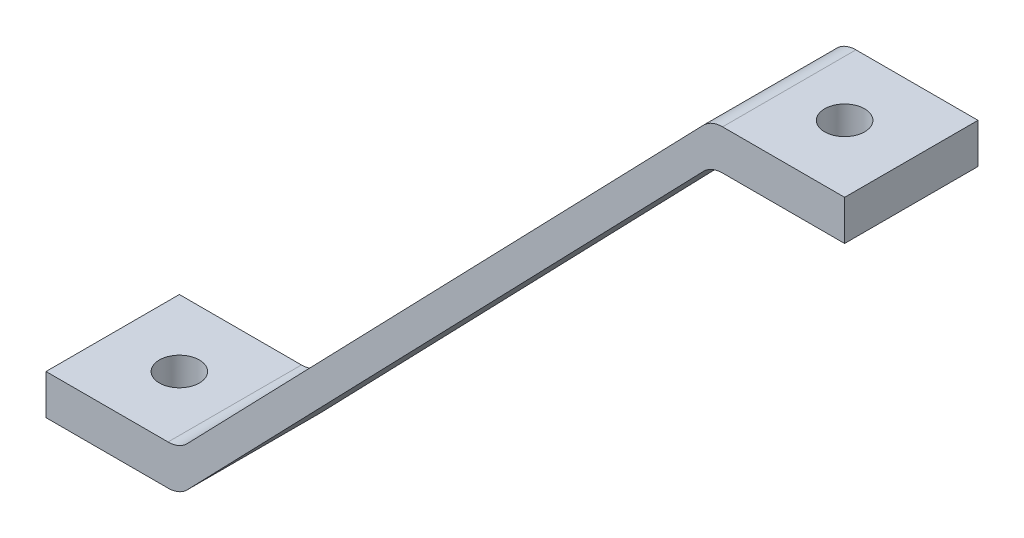
ISO-10303-21;
HEADER;
FILE_DESCRIPTION(('STEP AP214'),'2;1');
FILE_NAME('part.step','',(''),(''),'','','');
FILE_SCHEMA(('AUTOMOTIVE_DESIGN { 1 0 10303 214 1 1 1 1 }'));
ENDSEC;
DATA;
#1=APPLICATION_CONTEXT('core data for automotive mechanical design processes');
#2=APPLICATION_PROTOCOL_DEFINITION('international standard','automotive_design',2000,#1);
#3=PRODUCT_CONTEXT('',#1,'mechanical');
#4=PRODUCT('Part','Part','',(#3));
#5=PRODUCT_RELATED_PRODUCT_CATEGORY('part','',(#4));
#6=PRODUCT_DEFINITION_FORMATION('','',#4);
#7=PRODUCT_DEFINITION_CONTEXT('part definition',#1,'design');
#8=PRODUCT_DEFINITION('design','',#6,#7);
#9=PRODUCT_DEFINITION_SHAPE('','',#8);
#10=(LENGTH_UNIT() NAMED_UNIT(*) SI_UNIT(.MILLI.,.METRE.));
#11=(NAMED_UNIT(*) PLANE_ANGLE_UNIT() SI_UNIT($,.RADIAN.));
#12=(NAMED_UNIT(*) SI_UNIT($,.STERADIAN.) SOLID_ANGLE_UNIT());
#13=UNCERTAINTY_MEASURE_WITH_UNIT(LENGTH_MEASURE(1.E-05),#10,'distance_accuracy_value','');
#14=(GEOMETRIC_REPRESENTATION_CONTEXT(3) GLOBAL_UNCERTAINTY_ASSIGNED_CONTEXT((#13)) GLOBAL_UNIT_ASSIGNED_CONTEXT((#10,
#11,#12)) REPRESENTATION_CONTEXT('',''));
#15=CARTESIAN_POINT('',(0.,0.,0.));
#16=DIRECTION('',(0.,0.,1.));
#17=DIRECTION('',(1.,0.,0.));
#18=AXIS2_PLACEMENT_3D('',#15,#16,#17);
#19=CARTESIAN_POINT('',(0.,3.81,0.));
#20=DIRECTION('',(1.,0.,0.));
#21=DIRECTION('',(0.,0.,-1.));
#22=AXIS2_PLACEMENT_3D('',#19,#20,#21);
#23=PLANE('',#22);
#24=DIRECTION('',(0.,0.,1.));
#25=VECTOR('',#24,1.);
#26=CARTESIAN_POINT('',(0.,0.,0.));
#27=LINE('',#26,#25);
#28=CARTESIAN_POINT('',(0.,0.,-12.7));
#29=VERTEX_POINT('',#28);
#30=CARTESIAN_POINT('',(0.,0.,0.));
#31=VERTEX_POINT('',#30);
#32=EDGE_CURVE('E173',#29,#31,#27,.T.);
#33=ORIENTED_EDGE('',*,*,#32,.T.);
#34=DIRECTION('',(0.,-1.,0.));
#35=VECTOR('',#34,1.);
#36=CARTESIAN_POINT('',(0.,3.81,0.));
#37=LINE('',#36,#35);
#38=CARTESIAN_POINT('',(0.,3.81,0.));
#39=VERTEX_POINT('',#38);
#40=EDGE_CURVE('E200',#39,#31,#37,.T.);
#41=ORIENTED_EDGE('',*,*,#40,.F.);
#42=DIRECTION('',(0.,0.,1.));
#43=VECTOR('',#42,1.);
#44=CARTESIAN_POINT('',(0.,3.81,0.));
#45=LINE('',#44,#43);
#46=CARTESIAN_POINT('',(0.,3.81,-12.7));
#47=VERTEX_POINT('',#46);
#48=EDGE_CURVE('E175',#47,#39,#45,.T.);
#49=ORIENTED_EDGE('',*,*,#48,.F.);
#50=DIRECTION('',(0.,-1.,0.));
#51=VECTOR('',#50,1.);
#52=CARTESIAN_POINT('',(0.,3.81,-12.7));
#53=LINE('',#52,#51);
#54=EDGE_CURVE('E187',#47,#29,#53,.T.);
#55=ORIENTED_EDGE('',*,*,#54,.T.);
#56=EDGE_LOOP('',(#33,#41,#49,#55));
#57=FACE_BOUND('',#56,.T.);
#58=ADVANCED_FACE('F38',(#57),#23,.F.);
#59=CARTESIAN_POINT('',(0.,3.81,0.));
#60=DIRECTION('',(0.,0.,-1.));
#61=DIRECTION('',(-1.,0.,0.));
#62=AXIS2_PLACEMENT_3D('',#59,#60,#61);
#63=PLANE('',#62);
#64=DIRECTION('',(-1.,0.,0.));
#65=VECTOR('',#64,1.);
#66=CARTESIAN_POINT('',(63.3482559246675,56.1975,0.));
#67=LINE('',#66,#65);
#68=CARTESIAN_POINT('',(76.0482559246675,56.1975000000001,0.));
#69=VERTEX_POINT('',#68);
#70=CARTESIAN_POINT('',(64.4255604014743,56.1975,0.));
#71=VERTEX_POINT('',#70);
#72=EDGE_CURVE('E159',#69,#71,#67,.T.);
#73=ORIENTED_EDGE('',*,*,#72,.T.);
#74=CARTESIAN_POINT('',(64.4255604014743,53.6575,0.));
#75=DIRECTION('',(0.,0.,-1.));
#76=DIRECTION('',(-1.,0.,0.));
#77=AXIS2_PLACEMENT_3D('',#74,#75,#76);
#78=CIRCLE('',#77,2.54);
#79=CARTESIAN_POINT('',(62.5994519657933,55.4229823650025,0.));
#80=VERTEX_POINT('',#79);
#81=EDGE_CURVE('E211',#71,#80,#78,.F.);
#82=ORIENTED_EDGE('',*,*,#81,.T.);
#83=DIRECTION('',(-0.69507179724506,-0.718940329008272,0.));
#84=VECTOR('',#83,1.);
#85=CARTESIAN_POINT('',(63.3482559246675,56.1975,0.));
#86=LINE('',#85,#84);
#87=CARTESIAN_POINT('',(13.4488039588743,4.58451763499756,0.));
#88=VERTEX_POINT('',#87);
#89=EDGE_CURVE('E153',#80,#88,#86,.T.);
#90=ORIENTED_EDGE('',*,*,#89,.T.);
#91=CARTESIAN_POINT('',(11.6226955231932,6.35,0.));
#92=DIRECTION('',(0.,0.,-1.));
#93=DIRECTION('',(-1.,0.,0.));
#94=AXIS2_PLACEMENT_3D('',#91,#92,#93);
#95=CIRCLE('',#94,2.54);
#96=CARTESIAN_POINT('',(11.6226955231932,3.81,0.));
#97=VERTEX_POINT('',#96);
#98=EDGE_CURVE('E11',#88,#97,#95,.T.);
#99=ORIENTED_EDGE('',*,*,#98,.T.);
#100=DIRECTION('',(1.,0.,0.));
#101=VECTOR('',#100,1.);
#102=CARTESIAN_POINT('',(0.,3.81,0.));
#103=LINE('',#102,#101);
#104=EDGE_CURVE('E179',#39,#97,#103,.T.);
#105=ORIENTED_EDGE('',*,*,#104,.F.);
#106=ORIENTED_EDGE('',*,*,#40,.T.);
#107=DIRECTION('',(1.,0.,0.));
#108=VECTOR('',#107,1.);
#109=CARTESIAN_POINT('',(0.,0.,0.));
#110=LINE('',#109,#108);
#111=CARTESIAN_POINT('',(11.6226955231932,0.,0.));
#112=VERTEX_POINT('',#111);
#113=EDGE_CURVE('E191',#31,#112,#110,.T.);
#114=ORIENTED_EDGE('',*,*,#113,.T.);
#115=CARTESIAN_POINT('',(11.6226955231932,2.54,0.));
#116=DIRECTION('',(0.,0.,-1.));
#117=DIRECTION('',(-1.,0.,0.));
#118=AXIS2_PLACEMENT_3D('',#115,#116,#117);
#119=CIRCLE('',#118,2.54);
#120=CARTESIAN_POINT('',(13.4488039588742,0.774517634997547,0.));
#121=VERTEX_POINT('',#120);
#122=EDGE_CURVE('E208',#112,#121,#119,.F.);
#123=ORIENTED_EDGE('',*,*,#122,.T.);
#124=DIRECTION('',(0.69507179724506,0.718940329008272,0.));
#125=VECTOR('',#124,1.);
#126=CARTESIAN_POINT('',(12.7,0.,0.));
#127=LINE('',#126,#125);
#128=CARTESIAN_POINT('',(62.5994519657933,51.6129823650025,0.));
#129=VERTEX_POINT('',#128);
#130=EDGE_CURVE('E142',#121,#129,#127,.T.);
#131=ORIENTED_EDGE('',*,*,#130,.T.);
#132=CARTESIAN_POINT('',(64.4255604014743,49.8475,0.));
#133=DIRECTION('',(0.,0.,-1.));
#134=DIRECTION('',(-1.,0.,0.));
#135=AXIS2_PLACEMENT_3D('',#132,#133,#134);
#136=CIRCLE('',#135,2.54);
#137=CARTESIAN_POINT('',(64.4255604014743,52.3875,0.));
#138=VERTEX_POINT('',#137);
#139=EDGE_CURVE('E138',#129,#138,#136,.T.);
#140=ORIENTED_EDGE('',*,*,#139,.T.);
#141=DIRECTION('',(1.,0.,0.));
#142=VECTOR('',#141,1.);
#143=CARTESIAN_POINT('',(63.3482559246675,52.3875,0.));
#144=LINE('',#143,#142);
#145=CARTESIAN_POINT('',(76.0482559246675,52.3875,0.));
#146=VERTEX_POINT('',#145);
#147=EDGE_CURVE('E131',#138,#146,#144,.T.);
#148=ORIENTED_EDGE('',*,*,#147,.T.);
#149=DIRECTION('',(0.,1.,0.));
#150=VECTOR('',#149,1.);
#151=CARTESIAN_POINT('',(76.0482559246675,52.3875,0.));
#152=LINE('',#151,#150);
#153=EDGE_CURVE('E136',#146,#69,#152,.T.);
#154=ORIENTED_EDGE('',*,*,#153,.T.);
#155=EDGE_LOOP('',(#73,#82,#90,#99,#105,#106,#114,#123,#131,#140,#148,#154));
#156=FACE_BOUND('',#155,.T.);
#157=ADVANCED_FACE('F134',(#156),#63,.F.);
#158=CARTESIAN_POINT('',(0.,3.81,-12.7));
#159=DIRECTION('',(0.,0.,1.));
#160=DIRECTION('',(1.,0.,0.));
#161=AXIS2_PLACEMENT_3D('',#158,#159,#160);
#162=PLANE('',#161);
#163=DIRECTION('',(0.69507179724506,0.718940329008272,0.));
#164=VECTOR('',#163,1.);
#165=CARTESIAN_POINT('',(63.3482559246675,56.1975,-12.7));
#166=LINE('',#165,#164);
#167=CARTESIAN_POINT('',(13.4488039588742,4.58451763499754,-12.7));
#168=VERTEX_POINT('',#167);
#169=CARTESIAN_POINT('',(62.5994519657933,55.4229823650025,-12.7));
#170=VERTEX_POINT('',#169);
#171=EDGE_CURVE('E174',#168,#170,#166,.T.);
#172=ORIENTED_EDGE('',*,*,#171,.T.);
#173=CARTESIAN_POINT('',(64.4255604014743,53.6575,-12.7));
#174=DIRECTION('',(0.,0.,1.));
#175=DIRECTION('',(1.,0.,0.));
#176=AXIS2_PLACEMENT_3D('',#173,#174,#175);
#177=CIRCLE('',#176,2.54);
#178=CARTESIAN_POINT('',(64.4255604014743,56.1975,-12.7));
#179=VERTEX_POINT('',#178);
#180=EDGE_CURVE('E222',#170,#179,#177,.F.);
#181=ORIENTED_EDGE('',*,*,#180,.T.);
#182=DIRECTION('',(1.,0.,0.));
#183=VECTOR('',#182,1.);
#184=CARTESIAN_POINT('',(63.3482559246675,56.1975,-12.7));
#185=LINE('',#184,#183);
#186=CARTESIAN_POINT('',(76.0482559246675,56.1975000000001,-12.7));
#187=VERTEX_POINT('',#186);
#188=EDGE_CURVE('E261',#179,#187,#185,.T.);
#189=ORIENTED_EDGE('',*,*,#188,.T.);
#190=DIRECTION('',(0.,-1.,0.));
#191=VECTOR('',#190,1.);
#192=CARTESIAN_POINT('',(76.0482559246675,52.3875,-12.7));
#193=LINE('',#192,#191);
#194=CARTESIAN_POINT('',(76.0482559246675,52.3875,-12.7));
#195=VERTEX_POINT('',#194);
#196=EDGE_CURVE('E444',#187,#195,#193,.T.);
#197=ORIENTED_EDGE('',*,*,#196,.T.);
#198=DIRECTION('',(-1.,0.,0.));
#199=VECTOR('',#198,1.);
#200=CARTESIAN_POINT('',(63.3482559246675,52.3875,-12.7));
#201=LINE('',#200,#199);
#202=CARTESIAN_POINT('',(64.4255604014743,52.3875,-12.7));
#203=VERTEX_POINT('',#202);
#204=EDGE_CURVE('E148',#195,#203,#201,.T.);
#205=ORIENTED_EDGE('',*,*,#204,.T.);
#206=CARTESIAN_POINT('',(64.4255604014743,49.8475,-12.7));
#207=DIRECTION('',(0.,0.,1.));
#208=DIRECTION('',(1.,0.,0.));
#209=AXIS2_PLACEMENT_3D('',#206,#207,#208);
#210=CIRCLE('',#209,2.54);
#211=CARTESIAN_POINT('',(62.5994519657933,51.6129823650025,-12.7));
#212=VERTEX_POINT('',#211);
#213=EDGE_CURVE('E63',#203,#212,#210,.T.);
#214=ORIENTED_EDGE('',*,*,#213,.T.);
#215=DIRECTION('',(-0.69507179724506,-0.718940329008272,0.));
#216=VECTOR('',#215,1.);
#217=CARTESIAN_POINT('',(12.7,0.,-12.7));
#218=LINE('',#217,#216);
#219=CARTESIAN_POINT('',(13.4488039588742,0.774517634997547,-12.7));
#220=VERTEX_POINT('',#219);
#221=EDGE_CURVE('E170',#212,#220,#218,.T.);
#222=ORIENTED_EDGE('',*,*,#221,.T.);
#223=CARTESIAN_POINT('',(11.6226955231932,2.54,-12.7));
#224=DIRECTION('',(0.,0.,1.));
#225=DIRECTION('',(1.,0.,0.));
#226=AXIS2_PLACEMENT_3D('',#223,#224,#225);
#227=CIRCLE('',#226,2.54);
#228=CARTESIAN_POINT('',(11.6226955231932,0.,-12.7));
#229=VERTEX_POINT('',#228);
#230=EDGE_CURVE('E55',#220,#229,#227,.F.);
#231=ORIENTED_EDGE('',*,*,#230,.T.);
#232=DIRECTION('',(-1.,0.,0.));
#233=VECTOR('',#232,1.);
#234=CARTESIAN_POINT('',(0.,0.,-12.7));
#235=LINE('',#234,#233);
#236=EDGE_CURVE('E180',#229,#29,#235,.T.);
#237=ORIENTED_EDGE('',*,*,#236,.T.);
#238=ORIENTED_EDGE('',*,*,#54,.F.);
#239=DIRECTION('',(-1.,0.,0.));
#240=VECTOR('',#239,1.);
#241=CARTESIAN_POINT('',(0.,3.81,-12.7));
#242=LINE('',#241,#240);
#243=CARTESIAN_POINT('',(11.6226955231932,3.81,-12.7));
#244=VERTEX_POINT('',#243);
#245=EDGE_CURVE('E184',#244,#47,#242,.T.);
#246=ORIENTED_EDGE('',*,*,#245,.F.);
#247=CARTESIAN_POINT('',(11.6226955231932,6.35,-12.7));
#248=DIRECTION('',(0.,0.,1.));
#249=DIRECTION('',(1.,0.,0.));
#250=AXIS2_PLACEMENT_3D('',#247,#248,#249);
#251=CIRCLE('',#250,2.54);
#252=EDGE_CURVE('E48',#244,#168,#251,.T.);
#253=ORIENTED_EDGE('',*,*,#252,.T.);
#254=EDGE_LOOP('',(#172,#181,#189,#197,#205,#214,#222,#231,#237,#238,#246,#253));
#255=FACE_BOUND('',#254,.T.);
#256=ADVANCED_FACE('F250',(#255),#162,.F.);
#257=CARTESIAN_POINT('',(0.,3.81,0.));
#258=DIRECTION('',(0.,-1.,0.));
#259=DIRECTION('',(0.,0.,-1.));
#260=AXIS2_PLACEMENT_3D('',#257,#258,#259);
#261=PLANE('',#260);
#262=CARTESIAN_POINT('',(6.35,3.81,-6.35));
#263=DIRECTION('',(0.,-1.,0.));
#264=DIRECTION('',(0.,0.,-1.));
#265=AXIS2_PLACEMENT_3D('',#262,#263,#264);
#266=CIRCLE('',#265,1.905);
#267=CARTESIAN_POINT('',(6.35,3.81,-8.255));
#268=VERTEX_POINT('',#267);
#269=EDGE_CURVE('E429',#268,#268,#266,.T.);
#270=ORIENTED_EDGE('',*,*,#269,.T.);
#271=EDGE_LOOP('',(#270));
#272=FACE_BOUND('',#271,.T.);
#273=ORIENTED_EDGE('',*,*,#104,.T.);
#274=DIRECTION('',(0.,0.,-1.));
#275=VECTOR('',#274,1.);
#276=CARTESIAN_POINT('',(11.6226955231932,3.81,0.));
#277=LINE('',#276,#275);
#278=EDGE_CURVE('E238',#97,#244,#277,.T.);
#279=ORIENTED_EDGE('',*,*,#278,.T.);
#280=ORIENTED_EDGE('',*,*,#245,.T.);
#281=ORIENTED_EDGE('',*,*,#48,.T.);
#282=EDGE_LOOP('',(#273,#279,#280,#281));
#283=FACE_BOUND('',#282,.T.);
#284=ADVANCED_FACE('F265',(#272,#283),#261,.F.);
#285=CARTESIAN_POINT('',(0.,0.,0.));
#286=DIRECTION('',(0.,-1.,0.));
#287=DIRECTION('',(0.,0.,-1.));
#288=AXIS2_PLACEMENT_3D('',#285,#286,#287);
#289=PLANE('',#288);
#290=CARTESIAN_POINT('',(6.35,0.,-6.35));
#291=DIRECTION('',(0.,1.,0.));
#292=DIRECTION('',(0.,0.,1.));
#293=AXIS2_PLACEMENT_3D('',#290,#291,#292);
#294=CIRCLE('',#293,1.905);
#295=CARTESIAN_POINT('',(6.35,0.,-4.445));
#296=VERTEX_POINT('',#295);
#297=EDGE_CURVE('E430',#296,#296,#294,.T.);
#298=ORIENTED_EDGE('',*,*,#297,.T.);
#299=EDGE_LOOP('',(#298));
#300=FACE_BOUND('',#299,.T.);
#301=ORIENTED_EDGE('',*,*,#236,.F.);
#302=DIRECTION('',(0.,0.,-1.));
#303=VECTOR('',#302,1.);
#304=CARTESIAN_POINT('',(11.6226955231932,0.,0.));
#305=LINE('',#304,#303);
#306=EDGE_CURVE('E235',#229,#112,#305,.F.);
#307=ORIENTED_EDGE('',*,*,#306,.T.);
#308=ORIENTED_EDGE('',*,*,#113,.F.);
#309=ORIENTED_EDGE('',*,*,#32,.F.);
#310=EDGE_LOOP('',(#301,#307,#308,#309));
#311=FACE_BOUND('',#310,.T.);
#312=ADVANCED_FACE('F278',(#300,#311),#289,.T.);
#313=CARTESIAN_POINT('',(63.3482559246675,56.1975,-97.3827050521367));
#314=DIRECTION('',(-0.718940329008272,0.69507179724506,0.));
#315=DIRECTION('',(-0.69507179724506,-0.718940329008272,0.));
#316=AXIS2_PLACEMENT_3D('',#313,#314,#315);
#317=PLANE('',#316);
#318=ORIENTED_EDGE('',*,*,#89,.F.);
#319=DIRECTION('',(0.,0.,1.));
#320=VECTOR('',#319,1.);
#321=CARTESIAN_POINT('',(62.5994519657933,55.4229823650025,-97.3827050521367));
#322=LINE('',#321,#320);
#323=EDGE_CURVE('E217',#80,#170,#322,.F.);
#324=ORIENTED_EDGE('',*,*,#323,.T.);
#325=ORIENTED_EDGE('',*,*,#171,.F.);
#326=DIRECTION('',(0.,0.,-1.));
#327=VECTOR('',#326,1.);
#328=CARTESIAN_POINT('',(13.4488039588742,4.58451763499754,-97.3827050521367));
#329=LINE('',#328,#327);
#330=EDGE_CURVE('E214',#168,#88,#329,.F.);
#331=ORIENTED_EDGE('',*,*,#330,.T.);
#332=EDGE_LOOP('',(#318,#324,#325,#331));
#333=FACE_BOUND('',#332,.T.);
#334=ADVANCED_FACE('F258',(#333),#317,.T.);
#335=CARTESIAN_POINT('',(63.3482559246675,56.1975,-97.3827050521367));
#336=DIRECTION('',(0.,1.,0.));
#337=DIRECTION('',(-1.,0.,0.));
#338=AXIS2_PLACEMENT_3D('',#335,#336,#337);
#339=PLANE('',#338);
#340=CARTESIAN_POINT('',(69.6982559246675,56.1975000000001,-6.35));
#341=DIRECTION('',(0.,1.,0.));
#342=DIRECTION('',(0.,0.,1.));
#343=AXIS2_PLACEMENT_3D('',#340,#341,#342);
#344=CIRCLE('',#343,1.90500000000001);
#345=CARTESIAN_POINT('',(69.6982559246675,56.1975000000001,-4.445));
#346=VERTEX_POINT('',#345);
#347=EDGE_CURVE('E435',#346,#346,#344,.T.);
#348=ORIENTED_EDGE('',*,*,#347,.F.);
#349=EDGE_LOOP('',(#348));
#350=FACE_BOUND('',#349,.T.);
#351=ORIENTED_EDGE('',*,*,#188,.F.);
#352=DIRECTION('',(0.,0.,1.));
#353=VECTOR('',#352,1.);
#354=CARTESIAN_POINT('',(64.4255604014743,56.1975,-97.3827050521367));
#355=LINE('',#354,#353);
#356=EDGE_CURVE('E204',#179,#71,#355,.T.);
#357=ORIENTED_EDGE('',*,*,#356,.T.);
#358=ORIENTED_EDGE('',*,*,#72,.F.);
#359=DIRECTION('',(0.,0.,1.));
#360=VECTOR('',#359,1.);
#361=CARTESIAN_POINT('',(76.0482559246675,56.1975000000001,-97.3827050521367));
#362=LINE('',#361,#360);
#363=EDGE_CURVE('E152',#187,#69,#362,.T.);
#364=ORIENTED_EDGE('',*,*,#363,.F.);
#365=EDGE_LOOP('',(#351,#357,#358,#364));
#366=FACE_BOUND('',#365,.T.);
#367=ADVANCED_FACE('F287',(#350,#366),#339,.T.);
#368=CARTESIAN_POINT('',(76.0482559246675,52.3875,-97.3827050521367));
#369=DIRECTION('',(1.,0.,0.));
#370=DIRECTION('',(0.,0.,-1.));
#371=AXIS2_PLACEMENT_3D('',#368,#369,#370);
#372=PLANE('',#371);
#373=ORIENTED_EDGE('',*,*,#196,.F.);
#374=ORIENTED_EDGE('',*,*,#363,.T.);
#375=ORIENTED_EDGE('',*,*,#153,.F.);
#376=DIRECTION('',(0.,0.,1.));
#377=VECTOR('',#376,1.);
#378=CARTESIAN_POINT('',(76.0482559246675,52.3875,-97.3827050521367));
#379=LINE('',#378,#377);
#380=EDGE_CURVE('E146',#195,#146,#379,.T.);
#381=ORIENTED_EDGE('',*,*,#380,.F.);
#382=EDGE_LOOP('',(#373,#374,#375,#381));
#383=FACE_BOUND('',#382,.T.);
#384=ADVANCED_FACE('F155',(#383),#372,.T.);
#385=CARTESIAN_POINT('',(63.3482559246675,52.3875,-97.3827050521367));
#386=DIRECTION('',(0.,-1.,0.));
#387=DIRECTION('',(0.,0.,-1.));
#388=AXIS2_PLACEMENT_3D('',#385,#386,#387);
#389=PLANE('',#388);
#390=CARTESIAN_POINT('',(69.6982559246675,52.3875,-6.35));
#391=DIRECTION('',(0.,-1.,0.));
#392=DIRECTION('',(0.,0.,-1.));
#393=AXIS2_PLACEMENT_3D('',#390,#391,#392);
#394=CIRCLE('',#393,1.90500000000001);
#395=CARTESIAN_POINT('',(69.6982559246675,52.3875,-8.25500000000001));
#396=VERTEX_POINT('',#395);
#397=EDGE_CURVE('E42',#396,#396,#394,.T.);
#398=ORIENTED_EDGE('',*,*,#397,.F.);
#399=EDGE_LOOP('',(#398));
#400=FACE_BOUND('',#399,.T.);
#401=ORIENTED_EDGE('',*,*,#147,.F.);
#402=DIRECTION('',(0.,0.,1.));
#403=VECTOR('',#402,1.);
#404=CARTESIAN_POINT('',(64.4255604014743,52.3875,-12.7));
#405=LINE('',#404,#403);
#406=EDGE_CURVE('E232',#138,#203,#405,.F.);
#407=ORIENTED_EDGE('',*,*,#406,.T.);
#408=ORIENTED_EDGE('',*,*,#204,.F.);
#409=ORIENTED_EDGE('',*,*,#380,.T.);
#410=EDGE_LOOP('',(#401,#407,#408,#409));
#411=FACE_BOUND('',#410,.T.);
#412=ADVANCED_FACE('F147',(#400,#411),#389,.T.);
#413=CARTESIAN_POINT('',(12.7,0.,-97.3827050521367));
#414=DIRECTION('',(0.718940329008272,-0.69507179724506,0.));
#415=DIRECTION('',(0.69507179724506,0.718940329008272,0.));
#416=AXIS2_PLACEMENT_3D('',#413,#414,#415);
#417=PLANE('',#416);
#418=ORIENTED_EDGE('',*,*,#221,.F.);
#419=DIRECTION('',(0.,0.,1.));
#420=VECTOR('',#419,1.);
#421=CARTESIAN_POINT('',(62.5994519657933,51.6129823650025,0.));
#422=LINE('',#421,#420);
#423=EDGE_CURVE('E228',#212,#129,#422,.T.);
#424=ORIENTED_EDGE('',*,*,#423,.T.);
#425=ORIENTED_EDGE('',*,*,#130,.F.);
#426=DIRECTION('',(0.,0.,-1.));
#427=VECTOR('',#426,1.);
#428=CARTESIAN_POINT('',(13.4488039588742,0.774517634997547,-97.3827050521367));
#429=LINE('',#428,#427);
#430=EDGE_CURVE('E225',#121,#220,#429,.T.);
#431=ORIENTED_EDGE('',*,*,#430,.T.);
#432=EDGE_LOOP('',(#418,#424,#425,#431));
#433=FACE_BOUND('',#432,.T.);
#434=ADVANCED_FACE('F275',(#433),#417,.T.);
#435=CARTESIAN_POINT('',(64.4255604014743,53.6575,-97.3827050521367));
#436=DIRECTION('',(0.,0.,1.));
#437=DIRECTION('',(1.,0.,0.));
#438=AXIS2_PLACEMENT_3D('',#435,#436,#437);
#439=CYLINDRICAL_SURFACE('',#438,2.54);
#440=ORIENTED_EDGE('',*,*,#180,.F.);
#441=ORIENTED_EDGE('',*,*,#323,.F.);
#442=ORIENTED_EDGE('',*,*,#81,.F.);
#443=ORIENTED_EDGE('',*,*,#356,.F.);
#444=EDGE_LOOP('',(#440,#441,#442,#443));
#445=FACE_BOUND('',#444,.T.);
#446=ADVANCED_FACE('F301',(#445),#439,.T.);
#447=CARTESIAN_POINT('',(64.4255604014743,49.8475,-97.3827050521367));
#448=DIRECTION('',(0.,0.,-1.));
#449=DIRECTION('',(-1.,0.,0.));
#450=AXIS2_PLACEMENT_3D('',#447,#448,#449);
#451=CYLINDRICAL_SURFACE('',#450,2.54);
#452=ORIENTED_EDGE('',*,*,#213,.F.);
#453=ORIENTED_EDGE('',*,*,#406,.F.);
#454=ORIENTED_EDGE('',*,*,#139,.F.);
#455=ORIENTED_EDGE('',*,*,#423,.F.);
#456=EDGE_LOOP('',(#452,#453,#454,#455));
#457=FACE_BOUND('',#456,.T.);
#458=ADVANCED_FACE('F304',(#457),#451,.F.);
#459=CARTESIAN_POINT('',(11.6226955231932,2.54,-97.3827050521367));
#460=DIRECTION('',(0.,0.,-1.));
#461=DIRECTION('',(-1.,0.,0.));
#462=AXIS2_PLACEMENT_3D('',#459,#460,#461);
#463=CYLINDRICAL_SURFACE('',#462,2.54);
#464=ORIENTED_EDGE('',*,*,#122,.F.);
#465=ORIENTED_EDGE('',*,*,#306,.F.);
#466=ORIENTED_EDGE('',*,*,#230,.F.);
#467=ORIENTED_EDGE('',*,*,#430,.F.);
#468=EDGE_LOOP('',(#464,#465,#466,#467));
#469=FACE_BOUND('',#468,.T.);
#470=ADVANCED_FACE('F273',(#469),#463,.T.);
#471=CARTESIAN_POINT('',(11.6226955231932,6.35,0.));
#472=DIRECTION('',(0.,0.,-1.));
#473=DIRECTION('',(-1.,0.,0.));
#474=AXIS2_PLACEMENT_3D('',#471,#472,#473);
#475=CYLINDRICAL_SURFACE('',#474,2.54);
#476=ORIENTED_EDGE('',*,*,#98,.F.);
#477=ORIENTED_EDGE('',*,*,#330,.F.);
#478=ORIENTED_EDGE('',*,*,#252,.F.);
#479=ORIENTED_EDGE('',*,*,#278,.F.);
#480=EDGE_LOOP('',(#476,#477,#478,#479));
#481=FACE_BOUND('',#480,.T.);
#482=ADVANCED_FACE('F40',(#481),#475,.F.);
#483=CARTESIAN_POINT('',(69.6982559246675,0.,-6.35));
#484=DIRECTION('',(0.,1.,0.));
#485=DIRECTION('',(0.,0.,1.));
#486=AXIS2_PLACEMENT_3D('',#483,#484,#485);
#487=CYLINDRICAL_SURFACE('',#486,1.90500000000001);
#488=ORIENTED_EDGE('',*,*,#397,.T.);
#489=EDGE_LOOP('',(#488));
#490=FACE_BOUND('',#489,.T.);
#491=ORIENTED_EDGE('',*,*,#347,.T.);
#492=EDGE_LOOP('',(#491));
#493=FACE_BOUND('',#492,.T.);
#494=ADVANCED_FACE('F312',(#490,#493),#487,.F.);
#495=CARTESIAN_POINT('',(6.35,0.,-6.35));
#496=DIRECTION('',(0.,1.,0.));
#497=DIRECTION('',(0.,0.,1.));
#498=AXIS2_PLACEMENT_3D('',#495,#496,#497);
#499=CYLINDRICAL_SURFACE('',#498,1.905);
#500=ORIENTED_EDGE('',*,*,#297,.F.);
#501=EDGE_LOOP('',(#500));
#502=FACE_BOUND('',#501,.T.);
#503=ORIENTED_EDGE('',*,*,#269,.F.);
#504=EDGE_LOOP('',(#503));
#505=FACE_BOUND('',#504,.T.);
#506=ADVANCED_FACE('F316',(#502,#505),#499,.F.);
#507=CLOSED_SHELL('',(#58,#157,#256,#284,#312,#334,#367,#384,#412,#434,#446,#458,#470,#482,#494,#506));
#508=MANIFOLD_SOLID_BREP('B2',#507);
#509=ADVANCED_BREP_SHAPE_REPRESENTATION('',(#18,#508),#14);
#510=SHAPE_DEFINITION_REPRESENTATION(#9,#509);
ENDSEC;
END-ISO-10303-21;
